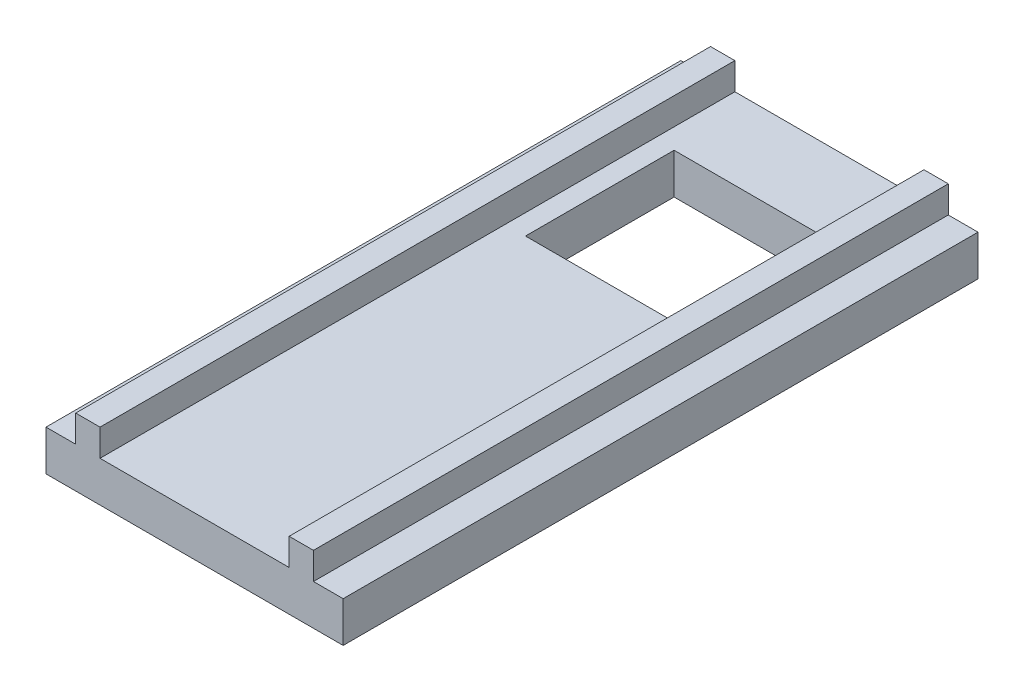
ISO-10303-21;
HEADER;
FILE_DESCRIPTION(('STEP AP214'),'2;1');
FILE_NAME('part.step','',(''),(''),'','','');
FILE_SCHEMA(('AUTOMOTIVE_DESIGN { 1 0 10303 214 1 1 1 1 }'));
ENDSEC;
DATA;
#1=APPLICATION_CONTEXT('core data for automotive mechanical design processes');
#2=APPLICATION_PROTOCOL_DEFINITION('international standard','automotive_design',2000,#1);
#3=PRODUCT_CONTEXT('',#1,'mechanical');
#4=PRODUCT('Part','Part','',(#3));
#5=PRODUCT_RELATED_PRODUCT_CATEGORY('part','',(#4));
#6=PRODUCT_DEFINITION_FORMATION('','',#4);
#7=PRODUCT_DEFINITION_CONTEXT('part definition',#1,'design');
#8=PRODUCT_DEFINITION('design','',#6,#7);
#9=PRODUCT_DEFINITION_SHAPE('','',#8);
#10=(LENGTH_UNIT() NAMED_UNIT(*) SI_UNIT(.MILLI.,.METRE.));
#11=(NAMED_UNIT(*) PLANE_ANGLE_UNIT() SI_UNIT($,.RADIAN.));
#12=(NAMED_UNIT(*) SI_UNIT($,.STERADIAN.) SOLID_ANGLE_UNIT());
#13=UNCERTAINTY_MEASURE_WITH_UNIT(LENGTH_MEASURE(1.E-05),#10,'distance_accuracy_value','');
#14=(GEOMETRIC_REPRESENTATION_CONTEXT(3) GLOBAL_UNCERTAINTY_ASSIGNED_CONTEXT((#13)) GLOBAL_UNIT_ASSIGNED_CONTEXT((#10,
#11,#12)) REPRESENTATION_CONTEXT('',''));
#15=CARTESIAN_POINT('',(0.,0.,0.));
#16=DIRECTION('',(0.,0.,1.));
#17=DIRECTION('',(1.,0.,0.));
#18=AXIS2_PLACEMENT_3D('',#15,#16,#17);
#19=CARTESIAN_POINT('',(0.,3.,0.));
#20=DIRECTION('',(0.,-1.,0.));
#21=DIRECTION('',(0.,0.,-1.));
#22=AXIS2_PLACEMENT_3D('',#19,#20,#21);
#23=PLANE('',#22);
#24=DIRECTION('',(0.,0.,-1.));
#25=VECTOR('',#24,1.);
#26=CARTESIAN_POINT('',(5.5,3.,-6.5));
#27=LINE('',#26,#25);
#28=CARTESIAN_POINT('',(5.5,3.,-6.5));
#29=VERTEX_POINT('',#28);
#30=CARTESIAN_POINT('',(5.5,3.,-17.5));
#31=VERTEX_POINT('',#30);
#32=EDGE_CURVE('E224',#29,#31,#27,.T.);
#33=ORIENTED_EDGE('',*,*,#32,.F.);
#34=DIRECTION('',(1.,0.,0.));
#35=VECTOR('',#34,1.);
#36=CARTESIAN_POINT('',(-5.5,3.,-6.5));
#37=LINE('',#36,#35);
#38=CARTESIAN_POINT('',(-5.5,3.,-6.5));
#39=VERTEX_POINT('',#38);
#40=EDGE_CURVE('E235',#39,#29,#37,.T.);
#41=ORIENTED_EDGE('',*,*,#40,.F.);
#42=DIRECTION('',(0.,0.,1.));
#43=VECTOR('',#42,1.);
#44=CARTESIAN_POINT('',(-5.5,3.,-6.5));
#45=LINE('',#44,#43);
#46=CARTESIAN_POINT('',(-5.5,3.,-17.5));
#47=VERTEX_POINT('',#46);
#48=EDGE_CURVE('E231',#47,#39,#45,.T.);
#49=ORIENTED_EDGE('',*,*,#48,.F.);
#50=DIRECTION('',(-1.,0.,0.));
#51=VECTOR('',#50,1.);
#52=CARTESIAN_POINT('',(-5.5,3.,-17.5));
#53=LINE('',#52,#51);
#54=EDGE_CURVE('E227',#31,#47,#53,.T.);
#55=ORIENTED_EDGE('',*,*,#54,.F.);
#56=EDGE_LOOP('',(#33,#41,#49,#55));
#57=FACE_BOUND('',#56,.T.);
#58=DIRECTION('',(0.,0.,1.));
#59=VECTOR('',#58,1.);
#60=CARTESIAN_POINT('',(7.,3.,23.5));
#61=LINE('',#60,#59);
#62=CARTESIAN_POINT('',(7.,3.,-23.5));
#63=VERTEX_POINT('',#62);
#64=CARTESIAN_POINT('',(7.,3.,23.5));
#65=VERTEX_POINT('',#64);
#66=EDGE_CURVE('E55',#63,#65,#61,.T.);
#67=ORIENTED_EDGE('',*,*,#66,.F.);
#68=DIRECTION('',(-1.,0.,0.));
#69=VECTOR('',#68,1.);
#70=CARTESIAN_POINT('',(-11.,3.,-23.5));
#71=LINE('',#70,#69);
#72=CARTESIAN_POINT('',(-7.,3.,-23.5));
#73=VERTEX_POINT('',#72);
#74=EDGE_CURVE('E275',#63,#73,#71,.T.);
#75=ORIENTED_EDGE('',*,*,#74,.T.);
#76=DIRECTION('',(0.,0.,-1.));
#77=VECTOR('',#76,1.);
#78=CARTESIAN_POINT('',(-7.,3.,23.5));
#79=LINE('',#78,#77);
#80=CARTESIAN_POINT('',(-7.,3.,23.5));
#81=VERTEX_POINT('',#80);
#82=EDGE_CURVE('E180',#81,#73,#79,.T.);
#83=ORIENTED_EDGE('',*,*,#82,.F.);
#84=DIRECTION('',(1.,0.,0.));
#85=VECTOR('',#84,1.);
#86=CARTESIAN_POINT('',(-11.,3.,23.5));
#87=LINE('',#86,#85);
#88=EDGE_CURVE('E283',#81,#65,#87,.T.);
#89=ORIENTED_EDGE('',*,*,#88,.T.);
#90=EDGE_LOOP('',(#67,#75,#83,#89));
#91=FACE_BOUND('',#90,.T.);
#92=ADVANCED_FACE('F39',(#57,#91),#23,.F.);
#93=DIRECTION('',(0.,0.,-1.));
#94=VECTOR('',#93,1.);
#95=CARTESIAN_POINT('',(8.8,3.,23.5));
#96=LINE('',#95,#94);
#97=CARTESIAN_POINT('',(8.8,3.,23.5));
#98=VERTEX_POINT('',#97);
#99=CARTESIAN_POINT('',(8.8,3.,-23.5));
#100=VERTEX_POINT('',#99);
#101=EDGE_CURVE('E176',#98,#100,#96,.T.);
#102=ORIENTED_EDGE('',*,*,#101,.F.);
#103=CARTESIAN_POINT('',(11.,3.,23.5));
#104=VERTEX_POINT('',#103);
#105=EDGE_CURVE('E278',#98,#104,#87,.T.);
#106=ORIENTED_EDGE('',*,*,#105,.T.);
#107=DIRECTION('',(0.,0.,-1.));
#108=VECTOR('',#107,1.);
#109=CARTESIAN_POINT('',(11.,3.,23.5));
#110=LINE('',#109,#108);
#111=CARTESIAN_POINT('',(11.,3.,-23.5));
#112=VERTEX_POINT('',#111);
#113=EDGE_CURVE('E267',#104,#112,#110,.T.);
#114=ORIENTED_EDGE('',*,*,#113,.T.);
#115=EDGE_CURVE('E63',#112,#100,#71,.T.);
#116=ORIENTED_EDGE('',*,*,#115,.T.);
#117=EDGE_LOOP('',(#102,#106,#114,#116));
#118=FACE_BOUND('',#117,.T.);
#119=ADVANCED_FACE('F321',(#118),#23,.F.);
#120=DIRECTION('',(0.,0.,1.));
#121=VECTOR('',#120,1.);
#122=CARTESIAN_POINT('',(-8.8,3.,23.5));
#123=LINE('',#122,#121);
#124=CARTESIAN_POINT('',(-8.8,3.,-23.5));
#125=VERTEX_POINT('',#124);
#126=CARTESIAN_POINT('',(-8.8,3.,23.5));
#127=VERTEX_POINT('',#126);
#128=EDGE_CURVE('E185',#125,#127,#123,.T.);
#129=ORIENTED_EDGE('',*,*,#128,.F.);
#130=CARTESIAN_POINT('',(-11.,3.,-23.5));
#131=VERTEX_POINT('',#130);
#132=EDGE_CURVE('E270',#125,#131,#71,.T.);
#133=ORIENTED_EDGE('',*,*,#132,.T.);
#134=DIRECTION('',(0.,0.,1.));
#135=VECTOR('',#134,1.);
#136=CARTESIAN_POINT('',(-11.,3.,23.5));
#137=LINE('',#136,#135);
#138=CARTESIAN_POINT('',(-11.,3.,23.5));
#139=VERTEX_POINT('',#138);
#140=EDGE_CURVE('E274',#131,#139,#137,.T.);
#141=ORIENTED_EDGE('',*,*,#140,.T.);
#142=EDGE_CURVE('E279',#139,#127,#87,.T.);
#143=ORIENTED_EDGE('',*,*,#142,.T.);
#144=EDGE_LOOP('',(#129,#133,#141,#143));
#145=FACE_BOUND('',#144,.T.);
#146=ADVANCED_FACE('F338',(#145),#23,.F.);
#147=CARTESIAN_POINT('',(0.,0.,0.));
#148=DIRECTION('',(0.,-1.,0.));
#149=DIRECTION('',(0.,0.,-1.));
#150=AXIS2_PLACEMENT_3D('',#147,#148,#149);
#151=PLANE('',#150);
#152=DIRECTION('',(0.,0.,-1.));
#153=VECTOR('',#152,1.);
#154=CARTESIAN_POINT('',(11.,0.,23.5));
#155=LINE('',#154,#153);
#156=CARTESIAN_POINT('',(11.,0.,23.5));
#157=VERTEX_POINT('',#156);
#158=CARTESIAN_POINT('',(11.,0.,-23.5));
#159=VERTEX_POINT('',#158);
#160=EDGE_CURVE('E266',#157,#159,#155,.T.);
#161=ORIENTED_EDGE('',*,*,#160,.F.);
#162=DIRECTION('',(1.,0.,0.));
#163=VECTOR('',#162,1.);
#164=CARTESIAN_POINT('',(-11.,0.,23.5));
#165=LINE('',#164,#163);
#166=CARTESIAN_POINT('',(-11.,0.,23.5));
#167=VERTEX_POINT('',#166);
#168=EDGE_CURVE('E271',#167,#157,#165,.T.);
#169=ORIENTED_EDGE('',*,*,#168,.F.);
#170=DIRECTION('',(0.,0.,1.));
#171=VECTOR('',#170,1.);
#172=CARTESIAN_POINT('',(-11.,0.,23.5));
#173=LINE('',#172,#171);
#174=CARTESIAN_POINT('',(-11.,0.,-23.5));
#175=VERTEX_POINT('',#174);
#176=EDGE_CURVE('E290',#175,#167,#173,.T.);
#177=ORIENTED_EDGE('',*,*,#176,.F.);
#178=DIRECTION('',(-1.,0.,0.));
#179=VECTOR('',#178,1.);
#180=CARTESIAN_POINT('',(-11.,0.,-23.5));
#181=LINE('',#180,#179);
#182=EDGE_CURVE('E287',#159,#175,#181,.T.);
#183=ORIENTED_EDGE('',*,*,#182,.F.);
#184=EDGE_LOOP('',(#161,#169,#177,#183));
#185=FACE_BOUND('',#184,.T.);
#186=DIRECTION('',(1.,0.,0.));
#187=VECTOR('',#186,1.);
#188=CARTESIAN_POINT('',(-5.5,0.,-6.5));
#189=LINE('',#188,#187);
#190=CARTESIAN_POINT('',(-5.5,0.,-6.5));
#191=VERTEX_POINT('',#190);
#192=CARTESIAN_POINT('',(5.5,0.,-6.5));
#193=VERTEX_POINT('',#192);
#194=EDGE_CURVE('E228',#191,#193,#189,.T.);
#195=ORIENTED_EDGE('',*,*,#194,.T.);
#196=DIRECTION('',(0.,0.,-1.));
#197=VECTOR('',#196,1.);
#198=CARTESIAN_POINT('',(5.5,0.,-6.5));
#199=LINE('',#198,#197);
#200=CARTESIAN_POINT('',(5.5,0.,-17.5));
#201=VERTEX_POINT('',#200);
#202=EDGE_CURVE('E223',#193,#201,#199,.T.);
#203=ORIENTED_EDGE('',*,*,#202,.T.);
#204=DIRECTION('',(-1.,0.,0.));
#205=VECTOR('',#204,1.);
#206=CARTESIAN_POINT('',(-5.5,0.,-17.5));
#207=LINE('',#206,#205);
#208=CARTESIAN_POINT('',(-5.5,0.,-17.5));
#209=VERTEX_POINT('',#208);
#210=EDGE_CURVE('E242',#201,#209,#207,.T.);
#211=ORIENTED_EDGE('',*,*,#210,.T.);
#212=DIRECTION('',(0.,0.,1.));
#213=VECTOR('',#212,1.);
#214=CARTESIAN_POINT('',(-5.5,0.,-6.5));
#215=LINE('',#214,#213);
#216=EDGE_CURVE('E246',#209,#191,#215,.T.);
#217=ORIENTED_EDGE('',*,*,#216,.T.);
#218=EDGE_LOOP('',(#195,#203,#211,#217));
#219=FACE_BOUND('',#218,.T.);
#220=ADVANCED_FACE('F314',(#185,#219),#151,.T.);
#221=CARTESIAN_POINT('',(11.,3.,23.5));
#222=DIRECTION('',(-1.,0.,0.));
#223=DIRECTION('',(0.,0.,1.));
#224=AXIS2_PLACEMENT_3D('',#221,#222,#223);
#225=PLANE('',#224);
#226=ORIENTED_EDGE('',*,*,#160,.T.);
#227=DIRECTION('',(0.,-1.,0.));
#228=VECTOR('',#227,1.);
#229=CARTESIAN_POINT('',(11.,3.,-23.5));
#230=LINE('',#229,#228);
#231=EDGE_CURVE('E11',#112,#159,#230,.T.);
#232=ORIENTED_EDGE('',*,*,#231,.F.);
#233=ORIENTED_EDGE('',*,*,#113,.F.);
#234=DIRECTION('',(0.,-1.,0.));
#235=VECTOR('',#234,1.);
#236=CARTESIAN_POINT('',(11.,3.,23.5));
#237=LINE('',#236,#235);
#238=EDGE_CURVE('E282',#104,#157,#237,.T.);
#239=ORIENTED_EDGE('',*,*,#238,.T.);
#240=EDGE_LOOP('',(#226,#232,#233,#239));
#241=FACE_BOUND('',#240,.T.);
#242=ADVANCED_FACE('F41',(#241),#225,.F.);
#243=CARTESIAN_POINT('',(-11.,3.,-23.5));
#244=DIRECTION('',(0.,0.,1.));
#245=DIRECTION('',(1.,0.,0.));
#246=AXIS2_PLACEMENT_3D('',#243,#244,#245);
#247=PLANE('',#246);
#248=ORIENTED_EDGE('',*,*,#182,.T.);
#249=DIRECTION('',(0.,-1.,0.));
#250=VECTOR('',#249,1.);
#251=CARTESIAN_POINT('',(-11.,3.,-23.5));
#252=LINE('',#251,#250);
#253=EDGE_CURVE('E48',#131,#175,#252,.T.);
#254=ORIENTED_EDGE('',*,*,#253,.F.);
#255=ORIENTED_EDGE('',*,*,#132,.F.);
#256=DIRECTION('',(0.,-1.,0.));
#257=VECTOR('',#256,1.);
#258=CARTESIAN_POINT('',(-8.8,5.,-23.5));
#259=LINE('',#258,#257);
#260=CARTESIAN_POINT('',(-8.8,5.,-23.5));
#261=VERTEX_POINT('',#260);
#262=EDGE_CURVE('E215',#261,#125,#259,.T.);
#263=ORIENTED_EDGE('',*,*,#262,.F.);
#264=DIRECTION('',(-1.,0.,0.));
#265=VECTOR('',#264,1.);
#266=CARTESIAN_POINT('',(-7.,5.,-23.5));
#267=LINE('',#266,#265);
#268=CARTESIAN_POINT('',(-7.,5.,-23.5));
#269=VERTEX_POINT('',#268);
#270=EDGE_CURVE('E195',#269,#261,#267,.T.);
#271=ORIENTED_EDGE('',*,*,#270,.F.);
#272=DIRECTION('',(0.,-1.,0.));
#273=VECTOR('',#272,1.);
#274=CARTESIAN_POINT('',(-7.,5.,-23.5));
#275=LINE('',#274,#273);
#276=EDGE_CURVE('E219',#269,#73,#275,.T.);
#277=ORIENTED_EDGE('',*,*,#276,.T.);
#278=ORIENTED_EDGE('',*,*,#74,.F.);
#279=DIRECTION('',(0.,-1.,0.));
#280=VECTOR('',#279,1.);
#281=CARTESIAN_POINT('',(7.,5.,-23.5));
#282=LINE('',#281,#280);
#283=CARTESIAN_POINT('',(7.,5.,-23.5));
#284=VERTEX_POINT('',#283);
#285=EDGE_CURVE('E342',#284,#63,#282,.T.);
#286=ORIENTED_EDGE('',*,*,#285,.F.);
#287=DIRECTION('',(-1.,0.,0.));
#288=VECTOR('',#287,1.);
#289=CARTESIAN_POINT('',(7.,5.,-23.5));
#290=LINE('',#289,#288);
#291=CARTESIAN_POINT('',(8.8,5.,-23.5));
#292=VERTEX_POINT('',#291);
#293=EDGE_CURVE('E171',#292,#284,#290,.T.);
#294=ORIENTED_EDGE('',*,*,#293,.F.);
#295=DIRECTION('',(0.,-1.,0.));
#296=VECTOR('',#295,1.);
#297=CARTESIAN_POINT('',(8.8,5.,-23.5));
#298=LINE('',#297,#296);
#299=EDGE_CURVE('E187',#292,#100,#298,.T.);
#300=ORIENTED_EDGE('',*,*,#299,.T.);
#301=ORIENTED_EDGE('',*,*,#115,.F.);
#302=ORIENTED_EDGE('',*,*,#231,.T.);
#303=EDGE_LOOP('',(#248,#254,#255,#263,#271,#277,#278,#286,#294,#300,#301,#302));
#304=FACE_BOUND('',#303,.T.);
#305=ADVANCED_FACE('F339',(#304),#247,.F.);
#306=CARTESIAN_POINT('',(-11.,3.,23.5));
#307=DIRECTION('',(1.,0.,0.));
#308=DIRECTION('',(0.,0.,-1.));
#309=AXIS2_PLACEMENT_3D('',#306,#307,#308);
#310=PLANE('',#309);
#311=ORIENTED_EDGE('',*,*,#176,.T.);
#312=DIRECTION('',(0.,-1.,0.));
#313=VECTOR('',#312,1.);
#314=CARTESIAN_POINT('',(-11.,3.,23.5));
#315=LINE('',#314,#313);
#316=EDGE_CURVE('E298',#139,#167,#315,.T.);
#317=ORIENTED_EDGE('',*,*,#316,.F.);
#318=ORIENTED_EDGE('',*,*,#140,.F.);
#319=ORIENTED_EDGE('',*,*,#253,.T.);
#320=EDGE_LOOP('',(#311,#317,#318,#319));
#321=FACE_BOUND('',#320,.T.);
#322=ADVANCED_FACE('F307',(#321),#310,.F.);
#323=CARTESIAN_POINT('',(-11.,3.,23.5));
#324=DIRECTION('',(0.,0.,-1.));
#325=DIRECTION('',(-1.,0.,0.));
#326=AXIS2_PLACEMENT_3D('',#323,#324,#325);
#327=PLANE('',#326);
#328=ORIENTED_EDGE('',*,*,#168,.T.);
#329=ORIENTED_EDGE('',*,*,#238,.F.);
#330=ORIENTED_EDGE('',*,*,#105,.F.);
#331=DIRECTION('',(0.,-1.,0.));
#332=VECTOR('',#331,1.);
#333=CARTESIAN_POINT('',(8.8,5.,23.5));
#334=LINE('',#333,#332);
#335=CARTESIAN_POINT('',(8.8,5.,23.5));
#336=VERTEX_POINT('',#335);
#337=EDGE_CURVE('E161',#336,#98,#334,.T.);
#338=ORIENTED_EDGE('',*,*,#337,.F.);
#339=DIRECTION('',(1.,0.,0.));
#340=VECTOR('',#339,1.);
#341=CARTESIAN_POINT('',(7.,5.,23.5));
#342=LINE('',#341,#340);
#343=CARTESIAN_POINT('',(7.,5.,23.5));
#344=VERTEX_POINT('',#343);
#345=EDGE_CURVE('E154',#344,#336,#342,.T.);
#346=ORIENTED_EDGE('',*,*,#345,.F.);
#347=DIRECTION('',(0.,-1.,0.));
#348=VECTOR('',#347,1.);
#349=CARTESIAN_POINT('',(7.,5.,23.5));
#350=LINE('',#349,#348);
#351=EDGE_CURVE('E159',#344,#65,#350,.T.);
#352=ORIENTED_EDGE('',*,*,#351,.T.);
#353=ORIENTED_EDGE('',*,*,#88,.F.);
#354=DIRECTION('',(0.,-1.,0.));
#355=VECTOR('',#354,1.);
#356=CARTESIAN_POINT('',(-7.,5.,23.5));
#357=LINE('',#356,#355);
#358=CARTESIAN_POINT('',(-7.,5.,23.5));
#359=VERTEX_POINT('',#358);
#360=EDGE_CURVE('E203',#359,#81,#357,.T.);
#361=ORIENTED_EDGE('',*,*,#360,.F.);
#362=DIRECTION('',(1.,0.,0.));
#363=VECTOR('',#362,1.);
#364=CARTESIAN_POINT('',(-7.,5.,23.5));
#365=LINE('',#364,#363);
#366=CARTESIAN_POINT('',(-8.8,5.,23.5));
#367=VERTEX_POINT('',#366);
#368=EDGE_CURVE('E201',#367,#359,#365,.T.);
#369=ORIENTED_EDGE('',*,*,#368,.F.);
#370=DIRECTION('',(0.,-1.,0.));
#371=VECTOR('',#370,1.);
#372=CARTESIAN_POINT('',(-8.8,5.,23.5));
#373=LINE('',#372,#371);
#374=EDGE_CURVE('E211',#367,#127,#373,.T.);
#375=ORIENTED_EDGE('',*,*,#374,.T.);
#376=ORIENTED_EDGE('',*,*,#142,.F.);
#377=ORIENTED_EDGE('',*,*,#316,.T.);
#378=EDGE_LOOP('',(#328,#329,#330,#338,#346,#352,#353,#361,#369,#375,#376,#377));
#379=FACE_BOUND('',#378,.T.);
#380=ADVANCED_FACE('F156',(#379),#327,.F.);
#381=CARTESIAN_POINT('',(5.5,3.,-6.5));
#382=DIRECTION('',(-1.,0.,0.));
#383=DIRECTION('',(0.,0.,1.));
#384=AXIS2_PLACEMENT_3D('',#381,#382,#383);
#385=PLANE('',#384);
#386=ORIENTED_EDGE('',*,*,#202,.F.);
#387=DIRECTION('',(0.,-1.,0.));
#388=VECTOR('',#387,1.);
#389=CARTESIAN_POINT('',(5.5,3.,-6.5));
#390=LINE('',#389,#388);
#391=EDGE_CURVE('E238',#29,#193,#390,.T.);
#392=ORIENTED_EDGE('',*,*,#391,.F.);
#393=ORIENTED_EDGE('',*,*,#32,.T.);
#394=DIRECTION('',(0.,-1.,0.));
#395=VECTOR('',#394,1.);
#396=CARTESIAN_POINT('',(5.5,3.,-17.5));
#397=LINE('',#396,#395);
#398=EDGE_CURVE('E262',#31,#201,#397,.T.);
#399=ORIENTED_EDGE('',*,*,#398,.T.);
#400=EDGE_LOOP('',(#386,#392,#393,#399));
#401=FACE_BOUND('',#400,.T.);
#402=ADVANCED_FACE('F385',(#401),#385,.T.);
#403=CARTESIAN_POINT('',(-5.5,3.,-17.5));
#404=DIRECTION('',(0.,0.,1.));
#405=DIRECTION('',(1.,0.,0.));
#406=AXIS2_PLACEMENT_3D('',#403,#404,#405);
#407=PLANE('',#406);
#408=ORIENTED_EDGE('',*,*,#210,.F.);
#409=ORIENTED_EDGE('',*,*,#398,.F.);
#410=ORIENTED_EDGE('',*,*,#54,.T.);
#411=DIRECTION('',(0.,-1.,0.));
#412=VECTOR('',#411,1.);
#413=CARTESIAN_POINT('',(-5.5,3.,-17.5));
#414=LINE('',#413,#412);
#415=EDGE_CURVE('E259',#47,#209,#414,.T.);
#416=ORIENTED_EDGE('',*,*,#415,.T.);
#417=EDGE_LOOP('',(#408,#409,#410,#416));
#418=FACE_BOUND('',#417,.T.);
#419=ADVANCED_FACE('F407',(#418),#407,.T.);
#420=CARTESIAN_POINT('',(-5.5,3.,-6.5));
#421=DIRECTION('',(1.,0.,0.));
#422=DIRECTION('',(0.,0.,-1.));
#423=AXIS2_PLACEMENT_3D('',#420,#421,#422);
#424=PLANE('',#423);
#425=ORIENTED_EDGE('',*,*,#216,.F.);
#426=ORIENTED_EDGE('',*,*,#415,.F.);
#427=ORIENTED_EDGE('',*,*,#48,.T.);
#428=DIRECTION('',(0.,-1.,0.));
#429=VECTOR('',#428,1.);
#430=CARTESIAN_POINT('',(-5.5,3.,-6.5));
#431=LINE('',#430,#429);
#432=EDGE_CURVE('E256',#39,#191,#431,.T.);
#433=ORIENTED_EDGE('',*,*,#432,.T.);
#434=EDGE_LOOP('',(#425,#426,#427,#433));
#435=FACE_BOUND('',#434,.T.);
#436=ADVANCED_FACE('F414',(#435),#424,.T.);
#437=CARTESIAN_POINT('',(-5.5,3.,-6.5));
#438=DIRECTION('',(0.,0.,-1.));
#439=DIRECTION('',(-1.,0.,0.));
#440=AXIS2_PLACEMENT_3D('',#437,#438,#439);
#441=PLANE('',#440);
#442=ORIENTED_EDGE('',*,*,#194,.F.);
#443=ORIENTED_EDGE('',*,*,#432,.F.);
#444=ORIENTED_EDGE('',*,*,#40,.T.);
#445=ORIENTED_EDGE('',*,*,#391,.T.);
#446=EDGE_LOOP('',(#442,#443,#444,#445));
#447=FACE_BOUND('',#446,.T.);
#448=ADVANCED_FACE('F422',(#447),#441,.T.);
#449=CARTESIAN_POINT('',(-7.,5.,23.5));
#450=DIRECTION('',(-1.,0.,0.));
#451=DIRECTION('',(0.,0.,1.));
#452=AXIS2_PLACEMENT_3D('',#449,#450,#451);
#453=PLANE('',#452);
#454=ORIENTED_EDGE('',*,*,#82,.T.);
#455=ORIENTED_EDGE('',*,*,#276,.F.);
#456=DIRECTION('',(0.,0.,-1.));
#457=VECTOR('',#456,1.);
#458=CARTESIAN_POINT('',(-7.,5.,23.5));
#459=LINE('',#458,#457);
#460=EDGE_CURVE('E191',#359,#269,#459,.T.);
#461=ORIENTED_EDGE('',*,*,#460,.F.);
#462=ORIENTED_EDGE('',*,*,#360,.T.);
#463=EDGE_LOOP('',(#454,#455,#461,#462));
#464=FACE_BOUND('',#463,.T.);
#465=ADVANCED_FACE('F328',(#464),#453,.F.);
#466=CARTESIAN_POINT('',(-8.8,5.,23.5));
#467=DIRECTION('',(1.,0.,0.));
#468=DIRECTION('',(0.,0.,-1.));
#469=AXIS2_PLACEMENT_3D('',#466,#467,#468);
#470=PLANE('',#469);
#471=ORIENTED_EDGE('',*,*,#128,.T.);
#472=ORIENTED_EDGE('',*,*,#374,.F.);
#473=DIRECTION('',(0.,0.,1.));
#474=VECTOR('',#473,1.);
#475=CARTESIAN_POINT('',(-8.8,5.,23.5));
#476=LINE('',#475,#474);
#477=EDGE_CURVE('E198',#261,#367,#476,.T.);
#478=ORIENTED_EDGE('',*,*,#477,.F.);
#479=ORIENTED_EDGE('',*,*,#262,.T.);
#480=EDGE_LOOP('',(#471,#472,#478,#479));
#481=FACE_BOUND('',#480,.T.);
#482=ADVANCED_FACE('F336',(#481),#470,.F.);
#483=CARTESIAN_POINT('',(0.,5.,0.));
#484=DIRECTION('',(0.,1.,0.));
#485=DIRECTION('',(0.,0.,1.));
#486=AXIS2_PLACEMENT_3D('',#483,#484,#485);
#487=PLANE('',#486);
#488=ORIENTED_EDGE('',*,*,#460,.T.);
#489=ORIENTED_EDGE('',*,*,#270,.T.);
#490=ORIENTED_EDGE('',*,*,#477,.T.);
#491=ORIENTED_EDGE('',*,*,#368,.T.);
#492=EDGE_LOOP('',(#488,#489,#490,#491));
#493=FACE_BOUND('',#492,.T.);
#494=ADVANCED_FACE('F331',(#493),#487,.T.);
#495=CARTESIAN_POINT('',(7.,5.,23.5));
#496=DIRECTION('',(1.,0.,0.));
#497=DIRECTION('',(0.,0.,-1.));
#498=AXIS2_PLACEMENT_3D('',#495,#496,#497);
#499=PLANE('',#498);
#500=ORIENTED_EDGE('',*,*,#66,.T.);
#501=ORIENTED_EDGE('',*,*,#351,.F.);
#502=DIRECTION('',(0.,0.,1.));
#503=VECTOR('',#502,1.);
#504=CARTESIAN_POINT('',(7.,5.,23.5));
#505=LINE('',#504,#503);
#506=EDGE_CURVE('E166',#284,#344,#505,.T.);
#507=ORIENTED_EDGE('',*,*,#506,.F.);
#508=ORIENTED_EDGE('',*,*,#285,.T.);
#509=EDGE_LOOP('',(#500,#501,#507,#508));
#510=FACE_BOUND('',#509,.T.);
#511=ADVANCED_FACE('F178',(#510),#499,.F.);
#512=CARTESIAN_POINT('',(8.8,5.,23.5));
#513=DIRECTION('',(-1.,0.,0.));
#514=DIRECTION('',(0.,0.,1.));
#515=AXIS2_PLACEMENT_3D('',#512,#513,#514);
#516=PLANE('',#515);
#517=ORIENTED_EDGE('',*,*,#101,.T.);
#518=ORIENTED_EDGE('',*,*,#299,.F.);
#519=DIRECTION('',(0.,0.,-1.));
#520=VECTOR('',#519,1.);
#521=CARTESIAN_POINT('',(8.8,5.,23.5));
#522=LINE('',#521,#520);
#523=EDGE_CURVE('E165',#336,#292,#522,.T.);
#524=ORIENTED_EDGE('',*,*,#523,.F.);
#525=ORIENTED_EDGE('',*,*,#337,.T.);
#526=EDGE_LOOP('',(#517,#518,#524,#525));
#527=FACE_BOUND('',#526,.T.);
#528=ADVANCED_FACE('F357',(#527),#516,.F.);
#529=CARTESIAN_POINT('',(0.,5.,0.));
#530=DIRECTION('',(0.,-1.,0.));
#531=DIRECTION('',(0.,0.,-1.));
#532=AXIS2_PLACEMENT_3D('',#529,#530,#531);
#533=PLANE('',#532);
#534=ORIENTED_EDGE('',*,*,#506,.T.);
#535=ORIENTED_EDGE('',*,*,#345,.T.);
#536=ORIENTED_EDGE('',*,*,#523,.T.);
#537=ORIENTED_EDGE('',*,*,#293,.T.);
#538=EDGE_LOOP('',(#534,#535,#536,#537));
#539=FACE_BOUND('',#538,.T.);
#540=ADVANCED_FACE('F169',(#539),#533,.F.);
#541=CLOSED_SHELL('',(#92,#119,#146,#220,#242,#305,#322,#380,#402,#419,#436,#448,#465,#482,#494,
#511,#528,#540));
#542=MANIFOLD_SOLID_BREP('B2',#541);
#543=ADVANCED_BREP_SHAPE_REPRESENTATION('',(#18,#542),#14);
#544=SHAPE_DEFINITION_REPRESENTATION(#9,#543);
ENDSEC;
END-ISO-10303-21;
